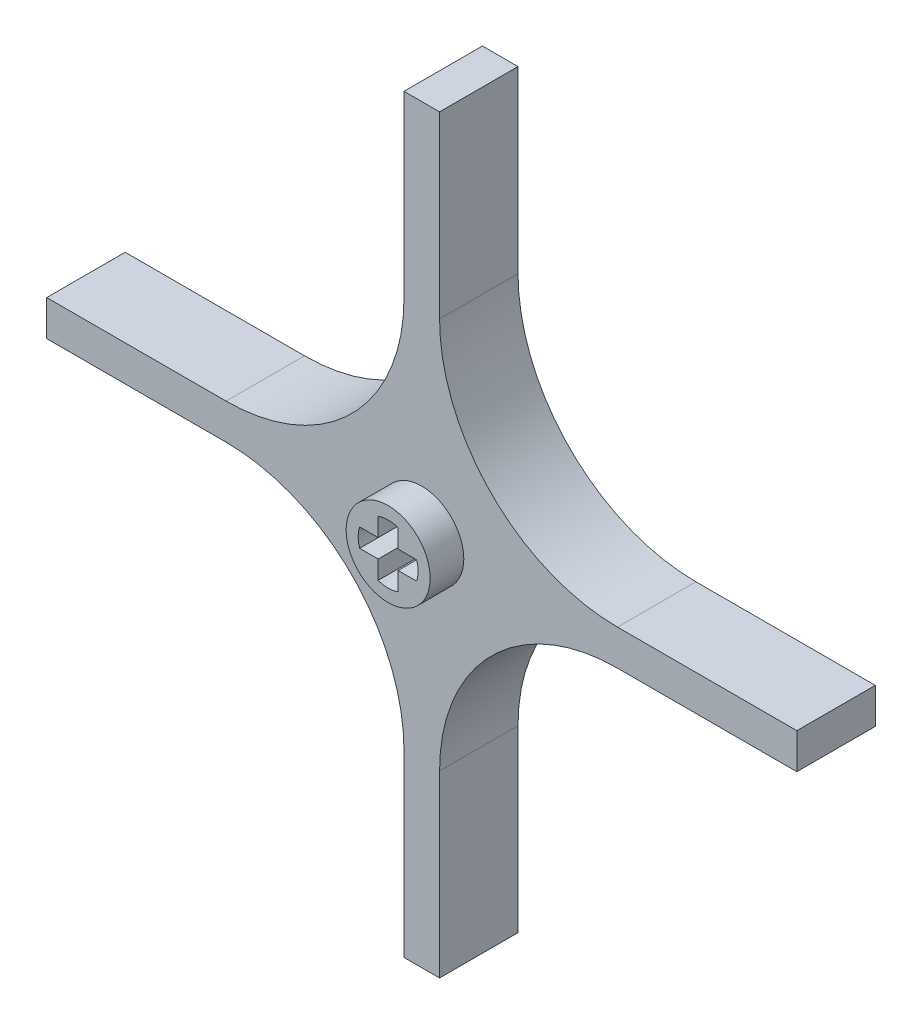
ISO-10303-21;
HEADER;
FILE_DESCRIPTION(('STEP AP214'),'2;1');
FILE_NAME('part.step','',(''),(''),'','','');
FILE_SCHEMA(('AUTOMOTIVE_DESIGN { 1 0 10303 214 1 1 1 1 }'));
ENDSEC;
DATA;
#1=APPLICATION_CONTEXT('core data for automotive mechanical design processes');
#2=APPLICATION_PROTOCOL_DEFINITION('international standard','automotive_design',2000,#1);
#3=PRODUCT_CONTEXT('',#1,'mechanical');
#4=PRODUCT('Part','Part','',(#3));
#5=PRODUCT_RELATED_PRODUCT_CATEGORY('part','',(#4));
#6=PRODUCT_DEFINITION_FORMATION('','',#4);
#7=PRODUCT_DEFINITION_CONTEXT('part definition',#1,'design');
#8=PRODUCT_DEFINITION('design','',#6,#7);
#9=PRODUCT_DEFINITION_SHAPE('','',#8);
#10=(LENGTH_UNIT() NAMED_UNIT(*) SI_UNIT(.MILLI.,.METRE.));
#11=(NAMED_UNIT(*) PLANE_ANGLE_UNIT() SI_UNIT($,.RADIAN.));
#12=(NAMED_UNIT(*) SI_UNIT($,.STERADIAN.) SOLID_ANGLE_UNIT());
#13=UNCERTAINTY_MEASURE_WITH_UNIT(LENGTH_MEASURE(1.E-05),#10,'distance_accuracy_value','');
#14=(GEOMETRIC_REPRESENTATION_CONTEXT(3) GLOBAL_UNCERTAINTY_ASSIGNED_CONTEXT((#13)) GLOBAL_UNIT_ASSIGNED_CONTEXT((#10,
#11,#12)) REPRESENTATION_CONTEXT('',''));
#15=CARTESIAN_POINT('',(0.,0.,0.));
#16=DIRECTION('',(0.,0.,1.));
#17=DIRECTION('',(1.,0.,0.));
#18=AXIS2_PLACEMENT_3D('',#15,#16,#17);
#19=CARTESIAN_POINT('',(0.,0.,-6.5));
#20=DIRECTION('',(0.,0.,-1.));
#21=DIRECTION('',(-1.,0.,0.));
#22=AXIS2_PLACEMENT_3D('',#19,#20,#21);
#23=PLANE('',#22);
#24=CARTESIAN_POINT('',(0.,0.,-6.5));
#25=DIRECTION('',(0.,0.,-1.));
#26=DIRECTION('',(-1.,0.,0.));
#27=AXIS2_PLACEMENT_3D('',#24,#25,#26);
#28=CIRCLE('',#27,3.75);
#29=CARTESIAN_POINT('',(-3.75,0.,-6.5));
#30=VERTEX_POINT('',#29);
#31=EDGE_CURVE('E305',#30,#30,#28,.T.);
#32=ORIENTED_EDGE('',*,*,#31,.T.);
#33=EDGE_LOOP('',(#32));
#34=FACE_BOUND('',#33,.T.);
#35=DIRECTION('',(-1.,0.,0.));
#36=VECTOR('',#35,1.);
#37=CARTESIAN_POINT('',(0.,0.8255,-6.5));
#38=LINE('',#37,#36);
#39=CARTESIAN_POINT('',(-0.889,0.8255,-6.5));
#40=VERTEX_POINT('',#39);
#41=CARTESIAN_POINT('',(-2.54,0.8255,-6.5));
#42=VERTEX_POINT('',#41);
#43=EDGE_CURVE('E275',#40,#42,#38,.T.);
#44=ORIENTED_EDGE('',*,*,#43,.T.);
#45=CARTESIAN_POINT('',(-0.0745284933708935,0.,-6.5));
#46=DIRECTION('',(0.,0.,-1.));
#47=DIRECTION('',(-1.,0.,0.));
#48=AXIS2_PLACEMENT_3D('',#45,#46,#47);
#49=CIRCLE('',#48,2.6);
#50=CARTESIAN_POINT('',(-2.54,-0.8255,-6.5));
#51=VERTEX_POINT('',#50);
#52=EDGE_CURVE('E58',#42,#51,#49,.F.);
#53=ORIENTED_EDGE('',*,*,#52,.T.);
#54=DIRECTION('',(-1.,0.,0.));
#55=VECTOR('',#54,1.);
#56=CARTESIAN_POINT('',(0.,-0.8255,-6.5));
#57=LINE('',#56,#55);
#58=CARTESIAN_POINT('',(-0.889,-0.8255,-6.5));
#59=VERTEX_POINT('',#58);
#60=EDGE_CURVE('E245',#59,#51,#57,.T.);
#61=ORIENTED_EDGE('',*,*,#60,.F.);
#62=DIRECTION('',(0.,1.,0.));
#63=VECTOR('',#62,1.);
#64=CARTESIAN_POINT('',(-0.889,0.,-6.5));
#65=LINE('',#64,#63);
#66=CARTESIAN_POINT('',(-0.889000000000001,-2.4765,-6.5));
#67=VERTEX_POINT('',#66);
#68=EDGE_CURVE('E248',#67,#59,#65,.T.);
#69=ORIENTED_EDGE('',*,*,#68,.F.);
#70=CARTESIAN_POINT('',(0.,-0.0332073445859999,-6.5));
#71=DIRECTION('',(0.,0.,-1.));
#72=DIRECTION('',(-1.,0.,0.));
#73=AXIS2_PLACEMENT_3D('',#70,#71,#72);
#74=CIRCLE('',#73,2.6);
#75=CARTESIAN_POINT('',(0.889000000000001,-2.4765,-6.5));
#76=VERTEX_POINT('',#75);
#77=EDGE_CURVE('E298',#76,#67,#74,.T.);
#78=ORIENTED_EDGE('',*,*,#77,.F.);
#79=DIRECTION('',(0.,-1.,0.));
#80=VECTOR('',#79,1.);
#81=CARTESIAN_POINT('',(0.889,0.,-6.5));
#82=LINE('',#81,#80);
#83=CARTESIAN_POINT('',(0.889,-0.8255,-6.5));
#84=VERTEX_POINT('',#83);
#85=EDGE_CURVE('E295',#84,#76,#82,.T.);
#86=ORIENTED_EDGE('',*,*,#85,.F.);
#87=DIRECTION('',(-1.,0.,0.));
#88=VECTOR('',#87,1.);
#89=CARTESIAN_POINT('',(0.,-0.8255,-6.5));
#90=LINE('',#89,#88);
#91=CARTESIAN_POINT('',(2.54,-0.8255,-6.5));
#92=VERTEX_POINT('',#91);
#93=EDGE_CURVE('E292',#92,#84,#90,.T.);
#94=ORIENTED_EDGE('',*,*,#93,.F.);
#95=CARTESIAN_POINT('',(0.0745284933708935,0.,-6.5));
#96=DIRECTION('',(0.,0.,-1.));
#97=DIRECTION('',(-1.,0.,0.));
#98=AXIS2_PLACEMENT_3D('',#95,#96,#97);
#99=CIRCLE('',#98,2.6);
#100=CARTESIAN_POINT('',(2.54,0.8255,-6.5));
#101=VERTEX_POINT('',#100);
#102=EDGE_CURVE('E289',#101,#92,#99,.T.);
#103=ORIENTED_EDGE('',*,*,#102,.F.);
#104=DIRECTION('',(1.,0.,0.));
#105=VECTOR('',#104,1.);
#106=CARTESIAN_POINT('',(0.,0.8255,-6.5));
#107=LINE('',#106,#105);
#108=CARTESIAN_POINT('',(0.889,0.8255,-6.5));
#109=VERTEX_POINT('',#108);
#110=EDGE_CURVE('E286',#109,#101,#107,.T.);
#111=ORIENTED_EDGE('',*,*,#110,.F.);
#112=DIRECTION('',(0.,1.,0.));
#113=VECTOR('',#112,1.);
#114=CARTESIAN_POINT('',(0.889,0.,-6.5));
#115=LINE('',#114,#113);
#116=CARTESIAN_POINT('',(0.889000000000001,2.4765,-6.5));
#117=VERTEX_POINT('',#116);
#118=EDGE_CURVE('E283',#109,#117,#115,.T.);
#119=ORIENTED_EDGE('',*,*,#118,.T.);
#120=CARTESIAN_POINT('',(0.,0.0332073445859999,-6.5));
#121=DIRECTION('',(0.,0.,-1.));
#122=DIRECTION('',(-1.,0.,0.));
#123=AXIS2_PLACEMENT_3D('',#120,#121,#122);
#124=CIRCLE('',#123,2.6);
#125=CARTESIAN_POINT('',(-0.889000000000001,2.4765,-6.5));
#126=VERTEX_POINT('',#125);
#127=EDGE_CURVE('E280',#117,#126,#124,.F.);
#128=ORIENTED_EDGE('',*,*,#127,.T.);
#129=DIRECTION('',(0.,-1.,0.));
#130=VECTOR('',#129,1.);
#131=CARTESIAN_POINT('',(-0.889,0.,-6.5));
#132=LINE('',#131,#130);
#133=EDGE_CURVE('E277',#126,#40,#132,.T.);
#134=ORIENTED_EDGE('',*,*,#133,.T.);
#135=EDGE_LOOP('',(#44,#53,#61,#69,#78,#86,#94,#103,#111,#119,#128,#134));
#136=FACE_BOUND('',#135,.T.);
#137=ADVANCED_FACE('F41',(#34,#136),#23,.T.);
#138=CARTESIAN_POINT('',(0.,0.,6.49999997));
#139=DIRECTION('',(0.,0.,-1.));
#140=DIRECTION('',(-1.,0.,0.));
#141=AXIS2_PLACEMENT_3D('',#138,#139,#140);
#142=PLANE('',#141);
#143=CARTESIAN_POINT('',(0.,0.,6.49999997));
#144=DIRECTION('',(0.,0.,-1.));
#145=DIRECTION('',(-1.,0.,0.));
#146=AXIS2_PLACEMENT_3D('',#143,#144,#145);
#147=CIRCLE('',#146,3.75);
#148=CARTESIAN_POINT('',(-3.75,0.,6.49999997));
#149=VERTEX_POINT('',#148);
#150=EDGE_CURVE('E327',#149,#149,#147,.T.);
#151=ORIENTED_EDGE('',*,*,#150,.F.);
#152=EDGE_LOOP('',(#151));
#153=FACE_BOUND('',#152,.T.);
#154=CARTESIAN_POINT('',(-0.0745284933708935,0.,6.49999997));
#155=DIRECTION('',(0.,0.,-1.));
#156=DIRECTION('',(-1.,0.,0.));
#157=AXIS2_PLACEMENT_3D('',#154,#155,#156);
#158=CIRCLE('',#157,2.6);
#159=CARTESIAN_POINT('',(-2.54,0.8255,6.49999997));
#160=VERTEX_POINT('',#159);
#161=CARTESIAN_POINT('',(-2.54,-0.8255,6.49999997));
#162=VERTEX_POINT('',#161);
#163=EDGE_CURVE('E235',#160,#162,#158,.F.);
#164=ORIENTED_EDGE('',*,*,#163,.F.);
#165=DIRECTION('',(-1.,0.,0.));
#166=VECTOR('',#165,1.);
#167=CARTESIAN_POINT('',(0.,0.8255,6.49999997));
#168=LINE('',#167,#166);
#169=CARTESIAN_POINT('',(-0.889,0.8255,6.49999997));
#170=VERTEX_POINT('',#169);
#171=EDGE_CURVE('E227',#170,#160,#168,.T.);
#172=ORIENTED_EDGE('',*,*,#171,.F.);
#173=DIRECTION('',(0.,-1.,0.));
#174=VECTOR('',#173,1.);
#175=CARTESIAN_POINT('',(-0.889,0.,6.49999997));
#176=LINE('',#175,#174);
#177=CARTESIAN_POINT('',(-0.889000000000001,2.4765,6.49999997));
#178=VERTEX_POINT('',#177);
#179=EDGE_CURVE('E234',#178,#170,#176,.T.);
#180=ORIENTED_EDGE('',*,*,#179,.F.);
#181=CARTESIAN_POINT('',(0.,0.0332073445859999,6.49999997));
#182=DIRECTION('',(0.,0.,-1.));
#183=DIRECTION('',(-1.,0.,0.));
#184=AXIS2_PLACEMENT_3D('',#181,#182,#183);
#185=CIRCLE('',#184,2.6);
#186=CARTESIAN_POINT('',(0.889000000000001,2.4765,6.49999997));
#187=VERTEX_POINT('',#186);
#188=EDGE_CURVE('E252',#187,#178,#185,.F.);
#189=ORIENTED_EDGE('',*,*,#188,.F.);
#190=DIRECTION('',(0.,1.,0.));
#191=VECTOR('',#190,1.);
#192=CARTESIAN_POINT('',(0.889,0.,6.49999997));
#193=LINE('',#192,#191);
#194=CARTESIAN_POINT('',(0.889,0.8255,6.49999997));
#195=VERTEX_POINT('',#194);
#196=EDGE_CURVE('E254',#195,#187,#193,.T.);
#197=ORIENTED_EDGE('',*,*,#196,.F.);
#198=DIRECTION('',(1.,0.,0.));
#199=VECTOR('',#198,1.);
#200=CARTESIAN_POINT('',(0.,0.8255,6.49999997));
#201=LINE('',#200,#199);
#202=CARTESIAN_POINT('',(2.54,0.8255,6.49999997));
#203=VERTEX_POINT('',#202);
#204=EDGE_CURVE('E256',#195,#203,#201,.T.);
#205=ORIENTED_EDGE('',*,*,#204,.T.);
#206=CARTESIAN_POINT('',(0.0745284933708935,0.,6.49999997));
#207=DIRECTION('',(0.,0.,-1.));
#208=DIRECTION('',(-1.,0.,0.));
#209=AXIS2_PLACEMENT_3D('',#206,#207,#208);
#210=CIRCLE('',#209,2.6);
#211=CARTESIAN_POINT('',(2.54,-0.8255,6.49999997));
#212=VERTEX_POINT('',#211);
#213=EDGE_CURVE('E259',#203,#212,#210,.T.);
#214=ORIENTED_EDGE('',*,*,#213,.T.);
#215=DIRECTION('',(-1.,0.,0.));
#216=VECTOR('',#215,1.);
#217=CARTESIAN_POINT('',(0.,-0.8255,6.49999997));
#218=LINE('',#217,#216);
#219=CARTESIAN_POINT('',(0.889,-0.8255,6.49999997));
#220=VERTEX_POINT('',#219);
#221=EDGE_CURVE('E262',#212,#220,#218,.T.);
#222=ORIENTED_EDGE('',*,*,#221,.T.);
#223=DIRECTION('',(0.,-1.,0.));
#224=VECTOR('',#223,1.);
#225=CARTESIAN_POINT('',(0.889,0.,6.49999997));
#226=LINE('',#225,#224);
#227=CARTESIAN_POINT('',(0.889000000000001,-2.4765,6.49999997));
#228=VERTEX_POINT('',#227);
#229=EDGE_CURVE('E265',#220,#228,#226,.T.);
#230=ORIENTED_EDGE('',*,*,#229,.T.);
#231=CARTESIAN_POINT('',(0.,-0.0332073445859999,6.49999997));
#232=DIRECTION('',(0.,0.,-1.));
#233=DIRECTION('',(-1.,0.,0.));
#234=AXIS2_PLACEMENT_3D('',#231,#232,#233);
#235=CIRCLE('',#234,2.6);
#236=CARTESIAN_POINT('',(-0.889000000000001,-2.4765,6.49999997));
#237=VERTEX_POINT('',#236);
#238=EDGE_CURVE('E268',#228,#237,#235,.T.);
#239=ORIENTED_EDGE('',*,*,#238,.T.);
#240=DIRECTION('',(0.,1.,0.));
#241=VECTOR('',#240,1.);
#242=CARTESIAN_POINT('',(-0.889,0.,6.49999997));
#243=LINE('',#242,#241);
#244=CARTESIAN_POINT('',(-0.889,-0.8255,6.49999997));
#245=VERTEX_POINT('',#244);
#246=EDGE_CURVE('E271',#237,#245,#243,.T.);
#247=ORIENTED_EDGE('',*,*,#246,.T.);
#248=DIRECTION('',(-1.,0.,0.));
#249=VECTOR('',#248,1.);
#250=CARTESIAN_POINT('',(0.,-0.8255,6.49999997));
#251=LINE('',#250,#249);
#252=EDGE_CURVE('E239',#245,#162,#251,.T.);
#253=ORIENTED_EDGE('',*,*,#252,.T.);
#254=EDGE_LOOP('',(#164,#172,#180,#189,#197,#205,#214,#222,#230,#239,#247,#253));
#255=FACE_BOUND('',#254,.T.);
#256=ADVANCED_FACE('F242',(#153,#255),#142,.F.);
#257=CARTESIAN_POINT('',(-33.4645,1.5875,3.5));
#258=DIRECTION('',(1.,0.,0.));
#259=DIRECTION('',(0.,1.,0.));
#260=AXIS2_PLACEMENT_3D('',#257,#258,#259);
#261=PLANE('',#260);
#262=DIRECTION('',(0.,-1.,0.));
#263=VECTOR('',#262,1.);
#264=CARTESIAN_POINT('',(-33.4645,1.5875,-3.5));
#265=LINE('',#264,#263);
#266=CARTESIAN_POINT('',(-33.4645,1.5875,-3.5));
#267=VERTEX_POINT('',#266);
#268=CARTESIAN_POINT('',(-33.4645,-1.5875,-3.5));
#269=VERTEX_POINT('',#268);
#270=EDGE_CURVE('E364',#267,#269,#265,.T.);
#271=ORIENTED_EDGE('',*,*,#270,.T.);
#272=DIRECTION('',(0.,0.,-1.));
#273=VECTOR('',#272,1.);
#274=CARTESIAN_POINT('',(-33.4645,-1.5875,3.5));
#275=LINE('',#274,#273);
#276=CARTESIAN_POINT('',(-33.4645,-1.5875,3.5));
#277=VERTEX_POINT('',#276);
#278=EDGE_CURVE('E412',#277,#269,#275,.T.);
#279=ORIENTED_EDGE('',*,*,#278,.F.);
#280=DIRECTION('',(0.,-1.,0.));
#281=VECTOR('',#280,1.);
#282=CARTESIAN_POINT('',(-33.4645,1.5875,3.5));
#283=LINE('',#282,#281);
#284=CARTESIAN_POINT('',(-33.4645,1.5875,3.5));
#285=VERTEX_POINT('',#284);
#286=EDGE_CURVE('E330',#285,#277,#283,.T.);
#287=ORIENTED_EDGE('',*,*,#286,.F.);
#288=DIRECTION('',(0.,0.,-1.));
#289=VECTOR('',#288,1.);
#290=CARTESIAN_POINT('',(-33.4645,1.5875,3.5));
#291=LINE('',#290,#289);
#292=EDGE_CURVE('E363',#285,#267,#291,.T.);
#293=ORIENTED_EDGE('',*,*,#292,.T.);
#294=EDGE_LOOP('',(#271,#279,#287,#293));
#295=FACE_BOUND('',#294,.T.);
#296=ADVANCED_FACE('F506',(#295),#261,.F.);
#297=CARTESIAN_POINT('',(-33.4645,-1.5875,3.5));
#298=DIRECTION('',(0.,1.,0.));
#299=DIRECTION('',(-1.,0.,0.));
#300=AXIS2_PLACEMENT_3D('',#297,#298,#299);
#301=PLANE('',#300);
#302=DIRECTION('',(1.,0.,0.));
#303=VECTOR('',#302,1.);
#304=CARTESIAN_POINT('',(-33.4645,-1.5875,-3.5));
#305=LINE('',#304,#303);
#306=CARTESIAN_POINT('',(-17.4625,-1.5875,-3.5));
#307=VERTEX_POINT('',#306);
#308=EDGE_CURVE('E367',#269,#307,#305,.T.);
#309=ORIENTED_EDGE('',*,*,#308,.T.);
#310=DIRECTION('',(0.,0.,-1.));
#311=VECTOR('',#310,1.);
#312=CARTESIAN_POINT('',(-17.4625,-1.5875,3.5));
#313=LINE('',#312,#311);
#314=CARTESIAN_POINT('',(-17.4625,-1.5875,3.5));
#315=VERTEX_POINT('',#314);
#316=EDGE_CURVE('E418',#307,#315,#313,.F.);
#317=ORIENTED_EDGE('',*,*,#316,.T.);
#318=DIRECTION('',(1.,0.,0.));
#319=VECTOR('',#318,1.);
#320=CARTESIAN_POINT('',(-33.4645,-1.5875,3.5));
#321=LINE('',#320,#319);
#322=EDGE_CURVE('E333',#277,#315,#321,.T.);
#323=ORIENTED_EDGE('',*,*,#322,.F.);
#324=ORIENTED_EDGE('',*,*,#278,.T.);
#325=EDGE_LOOP('',(#309,#317,#323,#324));
#326=FACE_BOUND('',#325,.T.);
#327=ADVANCED_FACE('F501',(#326),#301,.F.);
#328=CARTESIAN_POINT('',(-1.5875,-1.5875,3.5));
#329=DIRECTION('',(1.,0.,0.));
#330=DIRECTION('',(0.,1.,0.));
#331=AXIS2_PLACEMENT_3D('',#328,#329,#330);
#332=PLANE('',#331);
#333=DIRECTION('',(0.,-1.,0.));
#334=VECTOR('',#333,1.);
#335=CARTESIAN_POINT('',(-1.5875,-1.5875,3.5));
#336=LINE('',#335,#334);
#337=CARTESIAN_POINT('',(-1.5875,-17.4625,3.5));
#338=VERTEX_POINT('',#337);
#339=CARTESIAN_POINT('',(-1.5875,-33.4645,3.5));
#340=VERTEX_POINT('',#339);
#341=EDGE_CURVE('E337',#338,#340,#336,.T.);
#342=ORIENTED_EDGE('',*,*,#341,.F.);
#343=DIRECTION('',(0.,0.,-1.));
#344=VECTOR('',#343,1.);
#345=CARTESIAN_POINT('',(-1.5875,-17.4625,-3.5));
#346=LINE('',#345,#344);
#347=CARTESIAN_POINT('',(-1.5875,-17.4625,-3.5));
#348=VERTEX_POINT('',#347);
#349=EDGE_CURVE('E415',#338,#348,#346,.T.);
#350=ORIENTED_EDGE('',*,*,#349,.T.);
#351=DIRECTION('',(0.,-1.,0.));
#352=VECTOR('',#351,1.);
#353=CARTESIAN_POINT('',(-1.5875,-1.5875,-3.5));
#354=LINE('',#353,#352);
#355=CARTESIAN_POINT('',(-1.5875,-33.4645,-3.5));
#356=VERTEX_POINT('',#355);
#357=EDGE_CURVE('E370',#348,#356,#354,.T.);
#358=ORIENTED_EDGE('',*,*,#357,.T.);
#359=DIRECTION('',(0.,0.,-1.));
#360=VECTOR('',#359,1.);
#361=CARTESIAN_POINT('',(-1.5875,-33.4645,3.5));
#362=LINE('',#361,#360);
#363=EDGE_CURVE('E409',#340,#356,#362,.T.);
#364=ORIENTED_EDGE('',*,*,#363,.F.);
#365=EDGE_LOOP('',(#342,#350,#358,#364));
#366=FACE_BOUND('',#365,.T.);
#367=ADVANCED_FACE('F494',(#366),#332,.F.);
#368=CARTESIAN_POINT('',(-1.5875,-33.4645,3.5));
#369=DIRECTION('',(0.,1.,0.));
#370=DIRECTION('',(0.,0.,1.));
#371=AXIS2_PLACEMENT_3D('',#368,#369,#370);
#372=PLANE('',#371);
#373=DIRECTION('',(1.,0.,0.));
#374=VECTOR('',#373,1.);
#375=CARTESIAN_POINT('',(-1.5875,-33.4645,-3.5));
#376=LINE('',#375,#374);
#377=CARTESIAN_POINT('',(1.5875,-33.4645,-3.5));
#378=VERTEX_POINT('',#377);
#379=EDGE_CURVE('E372',#356,#378,#376,.T.);
#380=ORIENTED_EDGE('',*,*,#379,.T.);
#381=DIRECTION('',(0.,0.,-1.));
#382=VECTOR('',#381,1.);
#383=CARTESIAN_POINT('',(1.5875,-33.4645,3.5));
#384=LINE('',#383,#382);
#385=CARTESIAN_POINT('',(1.5875,-33.4645,3.5));
#386=VERTEX_POINT('',#385);
#387=EDGE_CURVE('E406',#386,#378,#384,.T.);
#388=ORIENTED_EDGE('',*,*,#387,.F.);
#389=DIRECTION('',(1.,0.,0.));
#390=VECTOR('',#389,1.);
#391=CARTESIAN_POINT('',(-1.5875,-33.4645,3.5));
#392=LINE('',#391,#390);
#393=EDGE_CURVE('E339',#340,#386,#392,.T.);
#394=ORIENTED_EDGE('',*,*,#393,.F.);
#395=ORIENTED_EDGE('',*,*,#363,.T.);
#396=EDGE_LOOP('',(#380,#388,#394,#395));
#397=FACE_BOUND('',#396,.T.);
#398=ADVANCED_FACE('F490',(#397),#372,.F.);
#399=CARTESIAN_POINT('',(1.5875,-1.5875,3.5));
#400=DIRECTION('',(1.,0.,0.));
#401=DIRECTION('',(0.,1.,0.));
#402=AXIS2_PLACEMENT_3D('',#399,#400,#401);
#403=PLANE('',#402);
#404=DIRECTION('',(0.,-1.,0.));
#405=VECTOR('',#404,1.);
#406=CARTESIAN_POINT('',(1.5875,-1.5875,-3.5));
#407=LINE('',#406,#405);
#408=CARTESIAN_POINT('',(1.5875,-17.4625,-3.5));
#409=VERTEX_POINT('',#408);
#410=EDGE_CURVE('E375',#409,#378,#407,.T.);
#411=ORIENTED_EDGE('',*,*,#410,.F.);
#412=DIRECTION('',(0.,0.,-1.));
#413=VECTOR('',#412,1.);
#414=CARTESIAN_POINT('',(1.5875,-17.4625,3.5));
#415=LINE('',#414,#413);
#416=CARTESIAN_POINT('',(1.5875,-17.4625,3.5));
#417=VERTEX_POINT('',#416);
#418=EDGE_CURVE('E428',#409,#417,#415,.F.);
#419=ORIENTED_EDGE('',*,*,#418,.T.);
#420=DIRECTION('',(0.,-1.,0.));
#421=VECTOR('',#420,1.);
#422=CARTESIAN_POINT('',(1.5875,-1.5875,3.5));
#423=LINE('',#422,#421);
#424=EDGE_CURVE('E342',#417,#386,#423,.T.);
#425=ORIENTED_EDGE('',*,*,#424,.T.);
#426=ORIENTED_EDGE('',*,*,#387,.T.);
#427=EDGE_LOOP('',(#411,#419,#425,#426));
#428=FACE_BOUND('',#427,.T.);
#429=ADVANCED_FACE('F484',(#428),#403,.T.);
#430=CARTESIAN_POINT('',(1.5875,-1.5875,3.5));
#431=DIRECTION('',(0.,1.,0.));
#432=DIRECTION('',(-1.,0.,0.));
#433=AXIS2_PLACEMENT_3D('',#430,#431,#432);
#434=PLANE('',#433);
#435=DIRECTION('',(1.,0.,0.));
#436=VECTOR('',#435,1.);
#437=CARTESIAN_POINT('',(1.5875,-1.5875,3.5));
#438=LINE('',#437,#436);
#439=CARTESIAN_POINT('',(17.4625,-1.5875,3.5));
#440=VERTEX_POINT('',#439);
#441=CARTESIAN_POINT('',(33.4645,-1.5875,3.5));
#442=VERTEX_POINT('',#441);
#443=EDGE_CURVE('E344',#440,#442,#438,.T.);
#444=ORIENTED_EDGE('',*,*,#443,.F.);
#445=DIRECTION('',(0.,0.,-1.));
#446=VECTOR('',#445,1.);
#447=CARTESIAN_POINT('',(17.4625,-1.5875,3.5));
#448=LINE('',#447,#446);
#449=CARTESIAN_POINT('',(17.4625,-1.5875,-3.5));
#450=VERTEX_POINT('',#449);
#451=EDGE_CURVE('E425',#440,#450,#448,.T.);
#452=ORIENTED_EDGE('',*,*,#451,.T.);
#453=DIRECTION('',(1.,0.,0.));
#454=VECTOR('',#453,1.);
#455=CARTESIAN_POINT('',(1.5875,-1.5875,-3.5));
#456=LINE('',#455,#454);
#457=CARTESIAN_POINT('',(33.4645,-1.5875,-3.5));
#458=VERTEX_POINT('',#457);
#459=EDGE_CURVE('E377',#450,#458,#456,.T.);
#460=ORIENTED_EDGE('',*,*,#459,.T.);
#461=DIRECTION('',(0.,0.,-1.));
#462=VECTOR('',#461,1.);
#463=CARTESIAN_POINT('',(33.4645,-1.5875,3.5));
#464=LINE('',#463,#462);
#465=EDGE_CURVE('E403',#442,#458,#464,.T.);
#466=ORIENTED_EDGE('',*,*,#465,.F.);
#467=EDGE_LOOP('',(#444,#452,#460,#466));
#468=FACE_BOUND('',#467,.T.);
#469=ADVANCED_FACE('F476',(#468),#434,.F.);
#470=CARTESIAN_POINT('',(33.4645,1.5875,3.5));
#471=DIRECTION('',(1.,0.,0.));
#472=DIRECTION('',(0.,0.,-1.));
#473=AXIS2_PLACEMENT_3D('',#470,#471,#472);
#474=PLANE('',#473);
#475=DIRECTION('',(0.,-1.,0.));
#476=VECTOR('',#475,1.);
#477=CARTESIAN_POINT('',(33.4645,1.5875,-3.5));
#478=LINE('',#477,#476);
#479=CARTESIAN_POINT('',(33.4645,1.5875,-3.5));
#480=VERTEX_POINT('',#479);
#481=EDGE_CURVE('E379',#480,#458,#478,.T.);
#482=ORIENTED_EDGE('',*,*,#481,.F.);
#483=DIRECTION('',(0.,0.,-1.));
#484=VECTOR('',#483,1.);
#485=CARTESIAN_POINT('',(33.4645,1.5875,3.5));
#486=LINE('',#485,#484);
#487=CARTESIAN_POINT('',(33.4645,1.5875,3.5));
#488=VERTEX_POINT('',#487);
#489=EDGE_CURVE('E400',#488,#480,#486,.T.);
#490=ORIENTED_EDGE('',*,*,#489,.F.);
#491=DIRECTION('',(0.,-1.,0.));
#492=VECTOR('',#491,1.);
#493=CARTESIAN_POINT('',(33.4645,1.5875,3.5));
#494=LINE('',#493,#492);
#495=EDGE_CURVE('E346',#488,#442,#494,.T.);
#496=ORIENTED_EDGE('',*,*,#495,.T.);
#497=ORIENTED_EDGE('',*,*,#465,.T.);
#498=EDGE_LOOP('',(#482,#490,#496,#497));
#499=FACE_BOUND('',#498,.T.);
#500=ADVANCED_FACE('F470',(#499),#474,.T.);
#501=CARTESIAN_POINT('',(1.5875,1.5875,3.5));
#502=DIRECTION('',(0.,1.,0.));
#503=DIRECTION('',(-1.,0.,0.));
#504=AXIS2_PLACEMENT_3D('',#501,#502,#503);
#505=PLANE('',#504);
#506=DIRECTION('',(1.,0.,0.));
#507=VECTOR('',#506,1.);
#508=CARTESIAN_POINT('',(1.5875,1.5875,-3.5));
#509=LINE('',#508,#507);
#510=CARTESIAN_POINT('',(17.4625,1.5875,-3.5));
#511=VERTEX_POINT('',#510);
#512=EDGE_CURVE('E382',#511,#480,#509,.T.);
#513=ORIENTED_EDGE('',*,*,#512,.F.);
#514=DIRECTION('',(0.,0.,-1.));
#515=VECTOR('',#514,1.);
#516=CARTESIAN_POINT('',(17.4625,1.5875,3.5));
#517=LINE('',#516,#515);
#518=CARTESIAN_POINT('',(17.4625,1.5875,3.5));
#519=VERTEX_POINT('',#518);
#520=EDGE_CURVE('E433',#511,#519,#517,.F.);
#521=ORIENTED_EDGE('',*,*,#520,.T.);
#522=DIRECTION('',(1.,0.,0.));
#523=VECTOR('',#522,1.);
#524=CARTESIAN_POINT('',(1.5875,1.5875,3.5));
#525=LINE('',#524,#523);
#526=EDGE_CURVE('E349',#519,#488,#525,.T.);
#527=ORIENTED_EDGE('',*,*,#526,.T.);
#528=ORIENTED_EDGE('',*,*,#489,.T.);
#529=EDGE_LOOP('',(#513,#521,#527,#528));
#530=FACE_BOUND('',#529,.T.);
#531=ADVANCED_FACE('F466',(#530),#505,.T.);
#532=CARTESIAN_POINT('',(1.5875,33.4645,3.5));
#533=DIRECTION('',(1.,0.,0.));
#534=DIRECTION('',(0.,1.,0.));
#535=AXIS2_PLACEMENT_3D('',#532,#533,#534);
#536=PLANE('',#535);
#537=DIRECTION('',(0.,-1.,0.));
#538=VECTOR('',#537,1.);
#539=CARTESIAN_POINT('',(1.5875,33.4645,3.5));
#540=LINE('',#539,#538);
#541=CARTESIAN_POINT('',(1.5875,33.4645,3.5));
#542=VERTEX_POINT('',#541);
#543=CARTESIAN_POINT('',(1.5875,17.4625,3.5));
#544=VERTEX_POINT('',#543);
#545=EDGE_CURVE('E351',#542,#544,#540,.T.);
#546=ORIENTED_EDGE('',*,*,#545,.T.);
#547=DIRECTION('',(0.,0.,-1.));
#548=VECTOR('',#547,1.);
#549=CARTESIAN_POINT('',(1.5875,17.4625,-3.5));
#550=LINE('',#549,#548);
#551=CARTESIAN_POINT('',(1.5875,17.4625,-3.5));
#552=VERTEX_POINT('',#551);
#553=EDGE_CURVE('E430',#544,#552,#550,.T.);
#554=ORIENTED_EDGE('',*,*,#553,.T.);
#555=DIRECTION('',(0.,-1.,0.));
#556=VECTOR('',#555,1.);
#557=CARTESIAN_POINT('',(1.5875,33.4645,-3.5));
#558=LINE('',#557,#556);
#559=CARTESIAN_POINT('',(1.5875,33.4645,-3.5));
#560=VERTEX_POINT('',#559);
#561=EDGE_CURVE('E384',#560,#552,#558,.T.);
#562=ORIENTED_EDGE('',*,*,#561,.F.);
#563=DIRECTION('',(0.,0.,-1.));
#564=VECTOR('',#563,1.);
#565=CARTESIAN_POINT('',(1.5875,33.4645,3.5));
#566=LINE('',#565,#564);
#567=EDGE_CURVE('E398',#542,#560,#566,.T.);
#568=ORIENTED_EDGE('',*,*,#567,.F.);
#569=EDGE_LOOP('',(#546,#554,#562,#568));
#570=FACE_BOUND('',#569,.T.);
#571=ADVANCED_FACE('F459',(#570),#536,.T.);
#572=CARTESIAN_POINT('',(-1.5875,33.4645,3.5));
#573=DIRECTION('',(0.,1.,0.));
#574=DIRECTION('',(0.,0.,1.));
#575=AXIS2_PLACEMENT_3D('',#572,#573,#574);
#576=PLANE('',#575);
#577=DIRECTION('',(1.,0.,0.));
#578=VECTOR('',#577,1.);
#579=CARTESIAN_POINT('',(-1.5875,33.4645,-3.5));
#580=LINE('',#579,#578);
#581=CARTESIAN_POINT('',(-1.5875,33.4645,-3.5));
#582=VERTEX_POINT('',#581);
#583=EDGE_CURVE('E387',#582,#560,#580,.T.);
#584=ORIENTED_EDGE('',*,*,#583,.F.);
#585=DIRECTION('',(0.,0.,-1.));
#586=VECTOR('',#585,1.);
#587=CARTESIAN_POINT('',(-1.5875,33.4645,3.5));
#588=LINE('',#587,#586);
#589=CARTESIAN_POINT('',(-1.5875,33.4645,3.5));
#590=VERTEX_POINT('',#589);
#591=EDGE_CURVE('E396',#590,#582,#588,.T.);
#592=ORIENTED_EDGE('',*,*,#591,.F.);
#593=DIRECTION('',(1.,0.,0.));
#594=VECTOR('',#593,1.);
#595=CARTESIAN_POINT('',(-1.5875,33.4645,3.5));
#596=LINE('',#595,#594);
#597=EDGE_CURVE('E354',#590,#542,#596,.T.);
#598=ORIENTED_EDGE('',*,*,#597,.T.);
#599=ORIENTED_EDGE('',*,*,#567,.T.);
#600=EDGE_LOOP('',(#584,#592,#598,#599));
#601=FACE_BOUND('',#600,.T.);
#602=ADVANCED_FACE('F521',(#601),#576,.T.);
#603=CARTESIAN_POINT('',(-1.5875,33.4645,3.5));
#604=DIRECTION('',(1.,0.,0.));
#605=DIRECTION('',(0.,1.,0.));
#606=AXIS2_PLACEMENT_3D('',#603,#604,#605);
#607=PLANE('',#606);
#608=DIRECTION('',(0.,-1.,0.));
#609=VECTOR('',#608,1.);
#610=CARTESIAN_POINT('',(-1.5875,33.4645,-3.5));
#611=LINE('',#610,#609);
#612=CARTESIAN_POINT('',(-1.5875,17.4625,-3.5));
#613=VERTEX_POINT('',#612);
#614=EDGE_CURVE('E390',#582,#613,#611,.T.);
#615=ORIENTED_EDGE('',*,*,#614,.T.);
#616=DIRECTION('',(0.,0.,-1.));
#617=VECTOR('',#616,1.);
#618=CARTESIAN_POINT('',(-1.5875,17.4625,3.5));
#619=LINE('',#618,#617);
#620=CARTESIAN_POINT('',(-1.5875,17.4625,3.5));
#621=VERTEX_POINT('',#620);
#622=EDGE_CURVE('E423',#613,#621,#619,.F.);
#623=ORIENTED_EDGE('',*,*,#622,.T.);
#624=DIRECTION('',(0.,-1.,0.));
#625=VECTOR('',#624,1.);
#626=CARTESIAN_POINT('',(-1.5875,33.4645,3.5));
#627=LINE('',#626,#625);
#628=EDGE_CURVE('E357',#590,#621,#627,.T.);
#629=ORIENTED_EDGE('',*,*,#628,.F.);
#630=ORIENTED_EDGE('',*,*,#591,.T.);
#631=EDGE_LOOP('',(#615,#623,#629,#630));
#632=FACE_BOUND('',#631,.T.);
#633=ADVANCED_FACE('F518',(#632),#607,.F.);
#634=CARTESIAN_POINT('',(-33.4645,1.5875,3.5));
#635=DIRECTION('',(0.,1.,0.));
#636=DIRECTION('',(-1.,0.,0.));
#637=AXIS2_PLACEMENT_3D('',#634,#635,#636);
#638=PLANE('',#637);
#639=DIRECTION('',(1.,0.,0.));
#640=VECTOR('',#639,1.);
#641=CARTESIAN_POINT('',(-33.4645,1.5875,3.5));
#642=LINE('',#641,#640);
#643=CARTESIAN_POINT('',(-17.4625,1.5875,3.5));
#644=VERTEX_POINT('',#643);
#645=EDGE_CURVE('E360',#285,#644,#642,.T.);
#646=ORIENTED_EDGE('',*,*,#645,.T.);
#647=DIRECTION('',(0.,0.,-1.));
#648=VECTOR('',#647,1.);
#649=CARTESIAN_POINT('',(-17.4625,1.5875,3.5));
#650=LINE('',#649,#648);
#651=CARTESIAN_POINT('',(-17.4625,1.5875,-3.5));
#652=VERTEX_POINT('',#651);
#653=EDGE_CURVE('E420',#644,#652,#650,.T.);
#654=ORIENTED_EDGE('',*,*,#653,.T.);
#655=DIRECTION('',(1.,0.,0.));
#656=VECTOR('',#655,1.);
#657=CARTESIAN_POINT('',(-33.4645,1.5875,-3.5));
#658=LINE('',#657,#656);
#659=EDGE_CURVE('E334',#267,#652,#658,.T.);
#660=ORIENTED_EDGE('',*,*,#659,.F.);
#661=ORIENTED_EDGE('',*,*,#292,.F.);
#662=EDGE_LOOP('',(#646,#654,#660,#661));
#663=FACE_BOUND('',#662,.T.);
#664=ADVANCED_FACE('F509',(#663),#638,.T.);
#665=CARTESIAN_POINT('',(0.,0.,3.5));
#666=DIRECTION('',(0.,0.,1.));
#667=DIRECTION('',(1.,0.,0.));
#668=AXIS2_PLACEMENT_3D('',#665,#666,#667);
#669=PLANE('',#668);
#670=CARTESIAN_POINT('',(0.,0.,3.5));
#671=DIRECTION('',(0.,0.,1.));
#672=DIRECTION('',(1.,0.,0.));
#673=AXIS2_PLACEMENT_3D('',#670,#671,#672);
#674=CIRCLE('',#673,3.75);
#675=CARTESIAN_POINT('',(3.75,0.,3.5));
#676=VERTEX_POINT('',#675);
#677=EDGE_CURVE('E11',#676,#676,#674,.T.);
#678=ORIENTED_EDGE('',*,*,#677,.F.);
#679=EDGE_LOOP('',(#678));
#680=FACE_BOUND('',#679,.T.);
#681=ORIENTED_EDGE('',*,*,#286,.T.);
#682=ORIENTED_EDGE('',*,*,#322,.T.);
#683=CARTESIAN_POINT('',(-17.4625,-17.4625,3.5));
#684=DIRECTION('',(0.,0.,1.));
#685=DIRECTION('',(1.,0.,0.));
#686=AXIS2_PLACEMENT_3D('',#683,#684,#685);
#687=CIRCLE('',#686,15.875);
#688=EDGE_CURVE('E437',#315,#338,#687,.F.);
#689=ORIENTED_EDGE('',*,*,#688,.T.);
#690=ORIENTED_EDGE('',*,*,#341,.T.);
#691=ORIENTED_EDGE('',*,*,#393,.T.);
#692=ORIENTED_EDGE('',*,*,#424,.F.);
#693=CARTESIAN_POINT('',(17.4625,-17.4625,3.5));
#694=DIRECTION('',(0.,0.,1.));
#695=DIRECTION('',(1.,0.,0.));
#696=AXIS2_PLACEMENT_3D('',#693,#694,#695);
#697=CIRCLE('',#696,15.875);
#698=EDGE_CURVE('E445',#417,#440,#697,.F.);
#699=ORIENTED_EDGE('',*,*,#698,.T.);
#700=ORIENTED_EDGE('',*,*,#443,.T.);
#701=ORIENTED_EDGE('',*,*,#495,.F.);
#702=ORIENTED_EDGE('',*,*,#526,.F.);
#703=CARTESIAN_POINT('',(17.4625,17.4625,3.5));
#704=DIRECTION('',(0.,0.,1.));
#705=DIRECTION('',(1.,0.,0.));
#706=AXIS2_PLACEMENT_3D('',#703,#704,#705);
#707=CIRCLE('',#706,15.875);
#708=EDGE_CURVE('E50',#519,#544,#707,.F.);
#709=ORIENTED_EDGE('',*,*,#708,.T.);
#710=ORIENTED_EDGE('',*,*,#545,.F.);
#711=ORIENTED_EDGE('',*,*,#597,.F.);
#712=ORIENTED_EDGE('',*,*,#628,.T.);
#713=CARTESIAN_POINT('',(-17.4625,17.4625,3.5));
#714=DIRECTION('',(0.,0.,1.));
#715=DIRECTION('',(1.,0.,0.));
#716=AXIS2_PLACEMENT_3D('',#713,#714,#715);
#717=CIRCLE('',#716,15.875);
#718=EDGE_CURVE('E441',#621,#644,#717,.F.);
#719=ORIENTED_EDGE('',*,*,#718,.T.);
#720=ORIENTED_EDGE('',*,*,#645,.F.);
#721=EDGE_LOOP('',(#681,#682,#689,#690,#691,#692,#699,#700,#701,#702,#709,#710,#711,#712,#719,#720));
#722=FACE_BOUND('',#721,.T.);
#723=ADVANCED_FACE('F452',(#680,#722),#669,.T.);
#724=CARTESIAN_POINT('',(0.,0.,-3.5));
#725=DIRECTION('',(0.,0.,1.));
#726=DIRECTION('',(1.,0.,0.));
#727=AXIS2_PLACEMENT_3D('',#724,#725,#726);
#728=PLANE('',#727);
#729=CARTESIAN_POINT('',(0.,0.,-3.5));
#730=DIRECTION('',(0.,0.,1.));
#731=DIRECTION('',(1.,0.,0.));
#732=AXIS2_PLACEMENT_3D('',#729,#730,#731);
#733=CIRCLE('',#732,3.75);
#734=CARTESIAN_POINT('',(3.75,0.,-3.5));
#735=VERTEX_POINT('',#734);
#736=EDGE_CURVE('E45',#735,#735,#733,.T.);
#737=ORIENTED_EDGE('',*,*,#736,.T.);
#738=EDGE_LOOP('',(#737));
#739=FACE_BOUND('',#738,.T.);
#740=ORIENTED_EDGE('',*,*,#270,.F.);
#741=ORIENTED_EDGE('',*,*,#659,.T.);
#742=CARTESIAN_POINT('',(-17.4625,17.4625,-3.5));
#743=DIRECTION('',(0.,0.,1.));
#744=DIRECTION('',(1.,0.,0.));
#745=AXIS2_PLACEMENT_3D('',#742,#743,#744);
#746=CIRCLE('',#745,15.875);
#747=EDGE_CURVE('E439',#652,#613,#746,.T.);
#748=ORIENTED_EDGE('',*,*,#747,.T.);
#749=ORIENTED_EDGE('',*,*,#614,.F.);
#750=ORIENTED_EDGE('',*,*,#583,.T.);
#751=ORIENTED_EDGE('',*,*,#561,.T.);
#752=CARTESIAN_POINT('',(17.4625,17.4625,-3.5));
#753=DIRECTION('',(0.,0.,1.));
#754=DIRECTION('',(1.,0.,0.));
#755=AXIS2_PLACEMENT_3D('',#752,#753,#754);
#756=CIRCLE('',#755,15.875);
#757=EDGE_CURVE('E447',#552,#511,#756,.T.);
#758=ORIENTED_EDGE('',*,*,#757,.T.);
#759=ORIENTED_EDGE('',*,*,#512,.T.);
#760=ORIENTED_EDGE('',*,*,#481,.T.);
#761=ORIENTED_EDGE('',*,*,#459,.F.);
#762=CARTESIAN_POINT('',(17.4625,-17.4625,-3.5));
#763=DIRECTION('',(0.,0.,1.));
#764=DIRECTION('',(1.,0.,0.));
#765=AXIS2_PLACEMENT_3D('',#762,#763,#764);
#766=CIRCLE('',#765,15.875);
#767=EDGE_CURVE('E443',#450,#409,#766,.T.);
#768=ORIENTED_EDGE('',*,*,#767,.T.);
#769=ORIENTED_EDGE('',*,*,#410,.T.);
#770=ORIENTED_EDGE('',*,*,#379,.F.);
#771=ORIENTED_EDGE('',*,*,#357,.F.);
#772=CARTESIAN_POINT('',(-17.4625,-17.4625,-3.5));
#773=DIRECTION('',(0.,0.,1.));
#774=DIRECTION('',(1.,0.,0.));
#775=AXIS2_PLACEMENT_3D('',#772,#773,#774);
#776=CIRCLE('',#775,15.875);
#777=EDGE_CURVE('E435',#348,#307,#776,.T.);
#778=ORIENTED_EDGE('',*,*,#777,.T.);
#779=ORIENTED_EDGE('',*,*,#308,.F.);
#780=EDGE_LOOP('',(#740,#741,#748,#749,#750,#751,#758,#759,#760,#761,#768,#769,#770,#771,#778,#779));
#781=FACE_BOUND('',#780,.T.);
#782=ADVANCED_FACE('F464',(#739,#781),#728,.F.);
#783=CARTESIAN_POINT('',(-17.4625,-17.4625,3.5));
#784=DIRECTION('',(0.,0.,1.));
#785=DIRECTION('',(1.,0.,0.));
#786=AXIS2_PLACEMENT_3D('',#783,#784,#785);
#787=CYLINDRICAL_SURFACE('',#786,15.875);
#788=ORIENTED_EDGE('',*,*,#688,.F.);
#789=ORIENTED_EDGE('',*,*,#316,.F.);
#790=ORIENTED_EDGE('',*,*,#777,.F.);
#791=ORIENTED_EDGE('',*,*,#349,.F.);
#792=EDGE_LOOP('',(#788,#789,#790,#791));
#793=FACE_BOUND('',#792,.T.);
#794=ADVANCED_FACE('F498',(#793),#787,.F.);
#795=CARTESIAN_POINT('',(-17.4625,17.4625,3.5));
#796=DIRECTION('',(0.,0.,-1.));
#797=DIRECTION('',(-1.,0.,0.));
#798=AXIS2_PLACEMENT_3D('',#795,#796,#797);
#799=CYLINDRICAL_SURFACE('',#798,15.875);
#800=ORIENTED_EDGE('',*,*,#718,.F.);
#801=ORIENTED_EDGE('',*,*,#622,.F.);
#802=ORIENTED_EDGE('',*,*,#747,.F.);
#803=ORIENTED_EDGE('',*,*,#653,.F.);
#804=EDGE_LOOP('',(#800,#801,#802,#803));
#805=FACE_BOUND('',#804,.T.);
#806=ADVANCED_FACE('F513',(#805),#799,.F.);
#807=CARTESIAN_POINT('',(17.4625,-17.4625,3.5));
#808=DIRECTION('',(0.,0.,-1.));
#809=DIRECTION('',(-1.,0.,0.));
#810=AXIS2_PLACEMENT_3D('',#807,#808,#809);
#811=CYLINDRICAL_SURFACE('',#810,15.875);
#812=ORIENTED_EDGE('',*,*,#698,.F.);
#813=ORIENTED_EDGE('',*,*,#418,.F.);
#814=ORIENTED_EDGE('',*,*,#767,.F.);
#815=ORIENTED_EDGE('',*,*,#451,.F.);
#816=EDGE_LOOP('',(#812,#813,#814,#815));
#817=FACE_BOUND('',#816,.T.);
#818=ADVANCED_FACE('F480',(#817),#811,.F.);
#819=CARTESIAN_POINT('',(17.4625,17.4625,3.5));
#820=DIRECTION('',(0.,0.,1.));
#821=DIRECTION('',(1.,0.,0.));
#822=AXIS2_PLACEMENT_3D('',#819,#820,#821);
#823=CYLINDRICAL_SURFACE('',#822,15.875);
#824=ORIENTED_EDGE('',*,*,#708,.F.);
#825=ORIENTED_EDGE('',*,*,#520,.F.);
#826=ORIENTED_EDGE('',*,*,#757,.F.);
#827=ORIENTED_EDGE('',*,*,#553,.F.);
#828=EDGE_LOOP('',(#824,#825,#826,#827));
#829=FACE_BOUND('',#828,.T.);
#830=ADVANCED_FACE('F43',(#829),#823,.F.);
#831=CARTESIAN_POINT('',(0.,0.,6.49999997));
#832=DIRECTION('',(0.,0.,-1.));
#833=DIRECTION('',(-1.,0.,0.));
#834=AXIS2_PLACEMENT_3D('',#831,#832,#833);
#835=CYLINDRICAL_SURFACE('',#834,3.75);
#836=ORIENTED_EDGE('',*,*,#31,.F.);
#837=EDGE_LOOP('',(#836));
#838=FACE_BOUND('',#837,.T.);
#839=ORIENTED_EDGE('',*,*,#736,.F.);
#840=EDGE_LOOP('',(#839));
#841=FACE_BOUND('',#840,.T.);
#842=ADVANCED_FACE('F545',(#838,#841),#835,.T.);
#843=ORIENTED_EDGE('',*,*,#677,.T.);
#844=EDGE_LOOP('',(#843));
#845=FACE_BOUND('',#844,.T.);
#846=ORIENTED_EDGE('',*,*,#150,.T.);
#847=EDGE_LOOP('',(#846));
#848=FACE_BOUND('',#847,.T.);
#849=ADVANCED_FACE('F542',(#845,#848),#835,.T.);
#850=CARTESIAN_POINT('',(-0.0745284933708935,0.,6.49999997));
#851=DIRECTION('',(0.,0.,-1.));
#852=DIRECTION('',(-1.,0.,0.));
#853=AXIS2_PLACEMENT_3D('',#850,#851,#852);
#854=CYLINDRICAL_SURFACE('',#853,2.6);
#855=ORIENTED_EDGE('',*,*,#52,.F.);
#856=DIRECTION('',(0.,0.,-1.));
#857=VECTOR('',#856,1.);
#858=CARTESIAN_POINT('',(-2.54,0.8255,6.49999997));
#859=LINE('',#858,#857);
#860=EDGE_CURVE('E229',#160,#42,#859,.T.);
#861=ORIENTED_EDGE('',*,*,#860,.F.);
#862=ORIENTED_EDGE('',*,*,#163,.T.);
#863=DIRECTION('',(0.,0.,-1.));
#864=VECTOR('',#863,1.);
#865=CARTESIAN_POINT('',(-2.54,-0.8255,6.49999997));
#866=LINE('',#865,#864);
#867=EDGE_CURVE('E303',#162,#51,#866,.T.);
#868=ORIENTED_EDGE('',*,*,#867,.T.);
#869=EDGE_LOOP('',(#855,#861,#862,#868));
#870=FACE_BOUND('',#869,.T.);
#871=ADVANCED_FACE('F237',(#870),#854,.F.);
#872=CARTESIAN_POINT('',(0.,-0.8255,6.49999997));
#873=DIRECTION('',(0.,-1.,0.));
#874=DIRECTION('',(1.,0.,0.));
#875=AXIS2_PLACEMENT_3D('',#872,#873,#874);
#876=PLANE('',#875);
#877=ORIENTED_EDGE('',*,*,#60,.T.);
#878=ORIENTED_EDGE('',*,*,#867,.F.);
#879=ORIENTED_EDGE('',*,*,#252,.F.);
#880=DIRECTION('',(0.,0.,-1.));
#881=VECTOR('',#880,1.);
#882=CARTESIAN_POINT('',(-0.889,-0.8255,6.49999997));
#883=LINE('',#882,#881);
#884=EDGE_CURVE('E306',#245,#59,#883,.T.);
#885=ORIENTED_EDGE('',*,*,#884,.T.);
#886=EDGE_LOOP('',(#877,#878,#879,#885));
#887=FACE_BOUND('',#886,.T.);
#888=ADVANCED_FACE('F604',(#887),#876,.F.);
#889=CARTESIAN_POINT('',(-0.889,0.,6.49999997));
#890=DIRECTION('',(-1.,0.,0.));
#891=DIRECTION('',(0.,-1.,0.));
#892=AXIS2_PLACEMENT_3D('',#889,#890,#891);
#893=PLANE('',#892);
#894=ORIENTED_EDGE('',*,*,#68,.T.);
#895=ORIENTED_EDGE('',*,*,#884,.F.);
#896=ORIENTED_EDGE('',*,*,#246,.F.);
#897=DIRECTION('',(0.,0.,-1.));
#898=VECTOR('',#897,1.);
#899=CARTESIAN_POINT('',(-0.889000000000001,-2.4765,6.49999997));
#900=LINE('',#899,#898);
#901=EDGE_CURVE('E308',#237,#67,#900,.T.);
#902=ORIENTED_EDGE('',*,*,#901,.T.);
#903=EDGE_LOOP('',(#894,#895,#896,#902));
#904=FACE_BOUND('',#903,.T.);
#905=ADVANCED_FACE('F611',(#904),#893,.F.);
#906=CARTESIAN_POINT('',(0.,-0.0332073445859999,6.49999997));
#907=DIRECTION('',(0.,0.,-1.));
#908=DIRECTION('',(-1.,0.,0.));
#909=AXIS2_PLACEMENT_3D('',#906,#907,#908);
#910=CYLINDRICAL_SURFACE('',#909,2.6);
#911=ORIENTED_EDGE('',*,*,#77,.T.);
#912=ORIENTED_EDGE('',*,*,#901,.F.);
#913=ORIENTED_EDGE('',*,*,#238,.F.);
#914=DIRECTION('',(0.,0.,-1.));
#915=VECTOR('',#914,1.);
#916=CARTESIAN_POINT('',(0.889000000000001,-2.4765,6.49999997));
#917=LINE('',#916,#915);
#918=EDGE_CURVE('E310',#228,#76,#917,.T.);
#919=ORIENTED_EDGE('',*,*,#918,.T.);
#920=EDGE_LOOP('',(#911,#912,#913,#919));
#921=FACE_BOUND('',#920,.T.);
#922=ADVANCED_FACE('F619',(#921),#910,.F.);
#923=CARTESIAN_POINT('',(0.889,0.,6.49999997));
#924=DIRECTION('',(1.,0.,0.));
#925=DIRECTION('',(0.,1.,0.));
#926=AXIS2_PLACEMENT_3D('',#923,#924,#925);
#927=PLANE('',#926);
#928=ORIENTED_EDGE('',*,*,#85,.T.);
#929=ORIENTED_EDGE('',*,*,#918,.F.);
#930=ORIENTED_EDGE('',*,*,#229,.F.);
#931=DIRECTION('',(0.,0.,-1.));
#932=VECTOR('',#931,1.);
#933=CARTESIAN_POINT('',(0.889,-0.8255,6.49999997));
#934=LINE('',#933,#932);
#935=EDGE_CURVE('E312',#220,#84,#934,.T.);
#936=ORIENTED_EDGE('',*,*,#935,.T.);
#937=EDGE_LOOP('',(#928,#929,#930,#936));
#938=FACE_BOUND('',#937,.T.);
#939=ADVANCED_FACE('F627',(#938),#927,.F.);
#940=CARTESIAN_POINT('',(0.,-0.8255,6.49999997));
#941=DIRECTION('',(0.,-1.,0.));
#942=DIRECTION('',(1.,0.,0.));
#943=AXIS2_PLACEMENT_3D('',#940,#941,#942);
#944=PLANE('',#943);
#945=ORIENTED_EDGE('',*,*,#93,.T.);
#946=ORIENTED_EDGE('',*,*,#935,.F.);
#947=ORIENTED_EDGE('',*,*,#221,.F.);
#948=DIRECTION('',(0.,0.,-1.));
#949=VECTOR('',#948,1.);
#950=CARTESIAN_POINT('',(2.54,-0.8255,6.49999997));
#951=LINE('',#950,#949);
#952=EDGE_CURVE('E314',#212,#92,#951,.T.);
#953=ORIENTED_EDGE('',*,*,#952,.T.);
#954=EDGE_LOOP('',(#945,#946,#947,#953));
#955=FACE_BOUND('',#954,.T.);
#956=ADVANCED_FACE('F635',(#955),#944,.F.);
#957=CARTESIAN_POINT('',(0.0745284933708935,0.,6.49999997));
#958=DIRECTION('',(0.,0.,-1.));
#959=DIRECTION('',(-1.,0.,0.));
#960=AXIS2_PLACEMENT_3D('',#957,#958,#959);
#961=CYLINDRICAL_SURFACE('',#960,2.6);
#962=ORIENTED_EDGE('',*,*,#102,.T.);
#963=ORIENTED_EDGE('',*,*,#952,.F.);
#964=ORIENTED_EDGE('',*,*,#213,.F.);
#965=DIRECTION('',(0.,0.,-1.));
#966=VECTOR('',#965,1.);
#967=CARTESIAN_POINT('',(2.54,0.8255,6.49999997));
#968=LINE('',#967,#966);
#969=EDGE_CURVE('E316',#203,#101,#968,.T.);
#970=ORIENTED_EDGE('',*,*,#969,.T.);
#971=EDGE_LOOP('',(#962,#963,#964,#970));
#972=FACE_BOUND('',#971,.T.);
#973=ADVANCED_FACE('F643',(#972),#961,.F.);
#974=CARTESIAN_POINT('',(0.,0.8255,6.49999997));
#975=DIRECTION('',(0.,1.,0.));
#976=DIRECTION('',(-1.,0.,0.));
#977=AXIS2_PLACEMENT_3D('',#974,#975,#976);
#978=PLANE('',#977);
#979=ORIENTED_EDGE('',*,*,#110,.T.);
#980=ORIENTED_EDGE('',*,*,#969,.F.);
#981=ORIENTED_EDGE('',*,*,#204,.F.);
#982=DIRECTION('',(0.,0.,-1.));
#983=VECTOR('',#982,1.);
#984=CARTESIAN_POINT('',(0.889,0.8255,6.49999997));
#985=LINE('',#984,#983);
#986=EDGE_CURVE('E318',#195,#109,#985,.T.);
#987=ORIENTED_EDGE('',*,*,#986,.T.);
#988=EDGE_LOOP('',(#979,#980,#981,#987));
#989=FACE_BOUND('',#988,.T.);
#990=ADVANCED_FACE('F651',(#989),#978,.F.);
#991=CARTESIAN_POINT('',(0.889,0.,6.49999997));
#992=DIRECTION('',(-1.,0.,0.));
#993=DIRECTION('',(0.,-1.,0.));
#994=AXIS2_PLACEMENT_3D('',#991,#992,#993);
#995=PLANE('',#994);
#996=ORIENTED_EDGE('',*,*,#118,.F.);
#997=ORIENTED_EDGE('',*,*,#986,.F.);
#998=ORIENTED_EDGE('',*,*,#196,.T.);
#999=DIRECTION('',(0.,0.,-1.));
#1000=VECTOR('',#999,1.);
#1001=CARTESIAN_POINT('',(0.889000000000001,2.4765,6.49999997));
#1002=LINE('',#1001,#1000);
#1003=EDGE_CURVE('E320',#187,#117,#1002,.T.);
#1004=ORIENTED_EDGE('',*,*,#1003,.T.);
#1005=EDGE_LOOP('',(#996,#997,#998,#1004));
#1006=FACE_BOUND('',#1005,.T.);
#1007=ADVANCED_FACE('F659',(#1006),#995,.T.);
#1008=CARTESIAN_POINT('',(0.,0.0332073445859999,6.49999997));
#1009=DIRECTION('',(0.,0.,-1.));
#1010=DIRECTION('',(-1.,0.,0.));
#1011=AXIS2_PLACEMENT_3D('',#1008,#1009,#1010);
#1012=CYLINDRICAL_SURFACE('',#1011,2.6);
#1013=ORIENTED_EDGE('',*,*,#127,.F.);
#1014=ORIENTED_EDGE('',*,*,#1003,.F.);
#1015=ORIENTED_EDGE('',*,*,#188,.T.);
#1016=DIRECTION('',(0.,0.,-1.));
#1017=VECTOR('',#1016,1.);
#1018=CARTESIAN_POINT('',(-0.889000000000001,2.4765,6.49999997));
#1019=LINE('',#1018,#1017);
#1020=EDGE_CURVE('E322',#178,#126,#1019,.T.);
#1021=ORIENTED_EDGE('',*,*,#1020,.T.);
#1022=EDGE_LOOP('',(#1013,#1014,#1015,#1021));
#1023=FACE_BOUND('',#1022,.T.);
#1024=ADVANCED_FACE('F667',(#1023),#1012,.F.);
#1025=CARTESIAN_POINT('',(-0.889,0.,6.49999997));
#1026=DIRECTION('',(1.,0.,0.));
#1027=DIRECTION('',(0.,1.,0.));
#1028=AXIS2_PLACEMENT_3D('',#1025,#1026,#1027);
#1029=PLANE('',#1028);
#1030=ORIENTED_EDGE('',*,*,#133,.F.);
#1031=ORIENTED_EDGE('',*,*,#1020,.F.);
#1032=ORIENTED_EDGE('',*,*,#179,.T.);
#1033=DIRECTION('',(0.,0.,-1.));
#1034=VECTOR('',#1033,1.);
#1035=CARTESIAN_POINT('',(-0.889,0.8255,6.49999997));
#1036=LINE('',#1035,#1034);
#1037=EDGE_CURVE('E66',#170,#40,#1036,.T.);
#1038=ORIENTED_EDGE('',*,*,#1037,.T.);
#1039=EDGE_LOOP('',(#1030,#1031,#1032,#1038));
#1040=FACE_BOUND('',#1039,.T.);
#1041=ADVANCED_FACE('F675',(#1040),#1029,.T.);
#1042=CARTESIAN_POINT('',(0.,0.8255,6.49999997));
#1043=DIRECTION('',(0.,-1.,0.));
#1044=DIRECTION('',(1.,0.,0.));
#1045=AXIS2_PLACEMENT_3D('',#1042,#1043,#1044);
#1046=PLANE('',#1045);
#1047=ORIENTED_EDGE('',*,*,#43,.F.);
#1048=ORIENTED_EDGE('',*,*,#1037,.F.);
#1049=ORIENTED_EDGE('',*,*,#171,.T.);
#1050=ORIENTED_EDGE('',*,*,#860,.T.);
#1051=EDGE_LOOP('',(#1047,#1048,#1049,#1050));
#1052=FACE_BOUND('',#1051,.T.);
#1053=ADVANCED_FACE('F228',(#1052),#1046,.T.);
#1054=CLOSED_SHELL('',(#137,#256,#296,#327,#367,#398,#429,#469,#500,#531,#571,#602,#633,#664,
#723,#782,#794,#806,#818,#830,#842,#849,#871,#888,#905,#922,#939,#956,#973,#990,#1007,#1024,
#1041,#1053));
#1055=MANIFOLD_SOLID_BREP('B2',#1054);
#1056=ADVANCED_BREP_SHAPE_REPRESENTATION('',(#18,#1055),#14);
#1057=SHAPE_DEFINITION_REPRESENTATION(#9,#1056);
ENDSEC;
END-ISO-10303-21;
